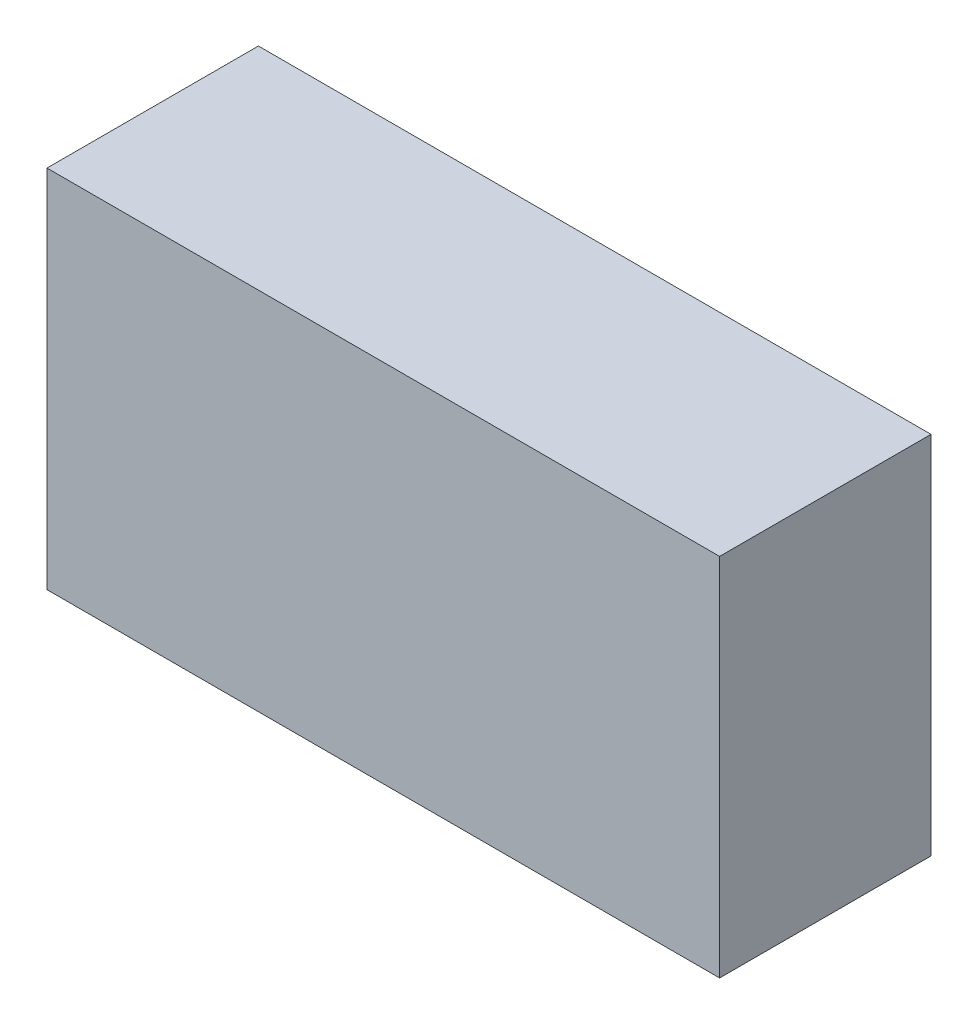
ISO-10303-21;
HEADER;
FILE_DESCRIPTION(('STEP AP214'),'2;1');
FILE_NAME('part.step','',(''),(''),'','','');
FILE_SCHEMA(('AUTOMOTIVE_DESIGN { 1 0 10303 214 1 1 1 1 }'));
ENDSEC;
DATA;
#1=APPLICATION_CONTEXT('core data for automotive mechanical design processes');
#2=APPLICATION_PROTOCOL_DEFINITION('international standard','automotive_design',2000,#1);
#3=PRODUCT_CONTEXT('',#1,'mechanical');
#4=PRODUCT('Part','Part','',(#3));
#5=PRODUCT_RELATED_PRODUCT_CATEGORY('part','',(#4));
#6=PRODUCT_DEFINITION_FORMATION('','',#4);
#7=PRODUCT_DEFINITION_CONTEXT('part definition',#1,'design');
#8=PRODUCT_DEFINITION('design','',#6,#7);
#9=PRODUCT_DEFINITION_SHAPE('','',#8);
#10=(LENGTH_UNIT() NAMED_UNIT(*) SI_UNIT(.MILLI.,.METRE.));
#11=(NAMED_UNIT(*) PLANE_ANGLE_UNIT() SI_UNIT($,.RADIAN.));
#12=(NAMED_UNIT(*) SI_UNIT($,.STERADIAN.) SOLID_ANGLE_UNIT());
#13=UNCERTAINTY_MEASURE_WITH_UNIT(LENGTH_MEASURE(1.E-05),#10,'distance_accuracy_value','');
#14=(GEOMETRIC_REPRESENTATION_CONTEXT(3) GLOBAL_UNCERTAINTY_ASSIGNED_CONTEXT((#13)) GLOBAL_UNIT_ASSIGNED_CONTEXT((#10,
#11,#12)) REPRESENTATION_CONTEXT('',''));
#15=CARTESIAN_POINT('',(0.,0.,0.));
#16=DIRECTION('',(0.,0.,1.));
#17=DIRECTION('',(1.,0.,0.));
#18=AXIS2_PLACEMENT_3D('',#15,#16,#17);
#19=CARTESIAN_POINT('',(0.87499952,0.47500032,0.5499989));
#20=DIRECTION('',(0.,0.,-1.));
#21=DIRECTION('',(-1.,0.,0.));
#22=AXIS2_PLACEMENT_3D('',#19,#20,#21);
#23=PLANE('',#22);
#24=DIRECTION('',(0.,1.,0.));
#25=VECTOR('',#24,1.);
#26=CARTESIAN_POINT('',(-0.87499952,0.47500032,0.5499989));
#27=LINE('',#26,#25);
#28=CARTESIAN_POINT('',(-0.87499952,0.47500032,0.5499989));
#29=VERTEX_POINT('',#28);
#30=CARTESIAN_POINT('',(-0.87499952,-0.47500032,0.5499989));
#31=VERTEX_POINT('',#30);
#32=EDGE_CURVE('E55',#29,#31,#27,.F.);
#33=ORIENTED_EDGE('',*,*,#32,.T.);
#34=DIRECTION('',(1.,0.,0.));
#35=VECTOR('',#34,1.);
#36=CARTESIAN_POINT('',(-0.87499952,-0.47500032,0.5499989));
#37=LINE('',#36,#35);
#38=CARTESIAN_POINT('',(0.87499952,-0.47500032,0.5499989));
#39=VERTEX_POINT('',#38);
#40=EDGE_CURVE('E57',#31,#39,#37,.T.);
#41=ORIENTED_EDGE('',*,*,#40,.T.);
#42=DIRECTION('',(0.,1.,0.));
#43=VECTOR('',#42,1.);
#44=CARTESIAN_POINT('',(0.87499952,-0.47500032,0.5499989));
#45=LINE('',#44,#43);
#46=CARTESIAN_POINT('',(0.87499952,0.47500032,0.5499989));
#47=VERTEX_POINT('',#46);
#48=EDGE_CURVE('E20',#39,#47,#45,.T.);
#49=ORIENTED_EDGE('',*,*,#48,.T.);
#50=DIRECTION('',(1.,0.,0.));
#51=VECTOR('',#50,1.);
#52=CARTESIAN_POINT('',(0.87499952,0.47500032,0.5499989));
#53=LINE('',#52,#51);
#54=EDGE_CURVE('E80',#47,#29,#53,.F.);
#55=ORIENTED_EDGE('',*,*,#54,.T.);
#56=EDGE_LOOP('',(#33,#41,#49,#55));
#57=FACE_BOUND('',#56,.T.);
#58=ADVANCED_FACE('F17',(#57),#23,.F.);
#59=CARTESIAN_POINT('',(0.87499952,-0.47500032,0.));
#60=DIRECTION('',(-1.,0.,0.));
#61=DIRECTION('',(0.,0.,1.));
#62=AXIS2_PLACEMENT_3D('',#59,#60,#61);
#63=PLANE('',#62);
#64=DIRECTION('',(0.,0.,-1.));
#65=VECTOR('',#64,1.);
#66=CARTESIAN_POINT('',(0.87499952,0.47500032,0.));
#67=LINE('',#66,#65);
#68=CARTESIAN_POINT('',(0.87499952,0.47500032,0.));
#69=VERTEX_POINT('',#68);
#70=EDGE_CURVE('E68',#69,#47,#67,.F.);
#71=ORIENTED_EDGE('',*,*,#70,.T.);
#72=ORIENTED_EDGE('',*,*,#48,.F.);
#73=DIRECTION('',(0.,0.,1.));
#74=VECTOR('',#73,1.);
#75=CARTESIAN_POINT('',(0.87499952,-0.47500032,0.));
#76=LINE('',#75,#74);
#77=CARTESIAN_POINT('',(0.87499952,-0.47500032,0.));
#78=VERTEX_POINT('',#77);
#79=EDGE_CURVE('E63',#39,#78,#76,.F.);
#80=ORIENTED_EDGE('',*,*,#79,.T.);
#81=DIRECTION('',(0.,1.,0.));
#82=VECTOR('',#81,1.);
#83=CARTESIAN_POINT('',(0.87499952,0.47500032,0.));
#84=LINE('',#83,#82);
#85=EDGE_CURVE('E83',#69,#78,#84,.F.);
#86=ORIENTED_EDGE('',*,*,#85,.F.);
#87=EDGE_LOOP('',(#71,#72,#80,#86));
#88=FACE_BOUND('',#87,.T.);
#89=ADVANCED_FACE('F65',(#88),#63,.F.);
#90=CARTESIAN_POINT('',(-0.87499952,-0.47500032,0.));
#91=DIRECTION('',(0.,1.,0.));
#92=DIRECTION('',(0.,0.,1.));
#93=AXIS2_PLACEMENT_3D('',#90,#91,#92);
#94=PLANE('',#93);
#95=ORIENTED_EDGE('',*,*,#79,.F.);
#96=ORIENTED_EDGE('',*,*,#40,.F.);
#97=DIRECTION('',(0.,0.,-1.));
#98=VECTOR('',#97,1.);
#99=CARTESIAN_POINT('',(-0.87499952,-0.47500032,0.));
#100=LINE('',#99,#98);
#101=CARTESIAN_POINT('',(-0.87499952,-0.47500032,0.));
#102=VERTEX_POINT('',#101);
#103=EDGE_CURVE('E75',#31,#102,#100,.T.);
#104=ORIENTED_EDGE('',*,*,#103,.T.);
#105=DIRECTION('',(-1.,0.,0.));
#106=VECTOR('',#105,1.);
#107=CARTESIAN_POINT('',(0.87499952,-0.47500032,0.));
#108=LINE('',#107,#106);
#109=EDGE_CURVE('E72',#78,#102,#108,.T.);
#110=ORIENTED_EDGE('',*,*,#109,.F.);
#111=EDGE_LOOP('',(#95,#96,#104,#110));
#112=FACE_BOUND('',#111,.T.);
#113=ADVANCED_FACE('F70',(#112),#94,.F.);
#114=CARTESIAN_POINT('',(-0.87499952,0.47500032,0.));
#115=DIRECTION('',(1.,0.,0.));
#116=DIRECTION('',(0.,0.,-1.));
#117=AXIS2_PLACEMENT_3D('',#114,#115,#116);
#118=PLANE('',#117);
#119=ORIENTED_EDGE('',*,*,#103,.F.);
#120=ORIENTED_EDGE('',*,*,#32,.F.);
#121=DIRECTION('',(0.,0.,-1.));
#122=VECTOR('',#121,1.);
#123=CARTESIAN_POINT('',(-0.87499952,0.47500032,0.));
#124=LINE('',#123,#122);
#125=CARTESIAN_POINT('',(-0.87499952,0.47500032,0.));
#126=VERTEX_POINT('',#125);
#127=EDGE_CURVE('E35',#29,#126,#124,.T.);
#128=ORIENTED_EDGE('',*,*,#127,.T.);
#129=DIRECTION('',(0.,1.,0.));
#130=VECTOR('',#129,1.);
#131=CARTESIAN_POINT('',(-0.87499952,0.47500032,0.));
#132=LINE('',#131,#130);
#133=EDGE_CURVE('E26',#102,#126,#132,.T.);
#134=ORIENTED_EDGE('',*,*,#133,.F.);
#135=EDGE_LOOP('',(#119,#120,#128,#134));
#136=FACE_BOUND('',#135,.T.);
#137=ADVANCED_FACE('F89',(#136),#118,.F.);
#138=CARTESIAN_POINT('',(0.87499952,0.47500032,0.));
#139=DIRECTION('',(0.,-1.,0.));
#140=DIRECTION('',(0.,0.,-1.));
#141=AXIS2_PLACEMENT_3D('',#138,#139,#140);
#142=PLANE('',#141);
#143=ORIENTED_EDGE('',*,*,#127,.F.);
#144=ORIENTED_EDGE('',*,*,#54,.F.);
#145=ORIENTED_EDGE('',*,*,#70,.F.);
#146=DIRECTION('',(-1.,0.,0.));
#147=VECTOR('',#146,1.);
#148=CARTESIAN_POINT('',(0.87499952,0.47500032,0.));
#149=LINE('',#148,#147);
#150=EDGE_CURVE('E11',#126,#69,#149,.F.);
#151=ORIENTED_EDGE('',*,*,#150,.F.);
#152=EDGE_LOOP('',(#143,#144,#145,#151));
#153=FACE_BOUND('',#152,.T.);
#154=ADVANCED_FACE('F91',(#153),#142,.F.);
#155=CARTESIAN_POINT('',(0.87499952,0.47500032,0.));
#156=DIRECTION('',(0.,0.,-1.));
#157=DIRECTION('',(-1.,0.,0.));
#158=AXIS2_PLACEMENT_3D('',#155,#156,#157);
#159=PLANE('',#158);
#160=ORIENTED_EDGE('',*,*,#133,.T.);
#161=ORIENTED_EDGE('',*,*,#150,.T.);
#162=ORIENTED_EDGE('',*,*,#85,.T.);
#163=ORIENTED_EDGE('',*,*,#109,.T.);
#164=EDGE_LOOP('',(#160,#161,#162,#163));
#165=FACE_BOUND('',#164,.T.);
#166=ADVANCED_FACE('F88',(#165),#159,.T.);
#167=CLOSED_SHELL('',(#58,#89,#113,#137,#154,#166));
#168=MANIFOLD_SOLID_BREP('B1',#167);
#169=ADVANCED_BREP_SHAPE_REPRESENTATION('',(#18,#168),#14);
#170=SHAPE_DEFINITION_REPRESENTATION(#9,#169);
ENDSEC;
END-ISO-10303-21;
